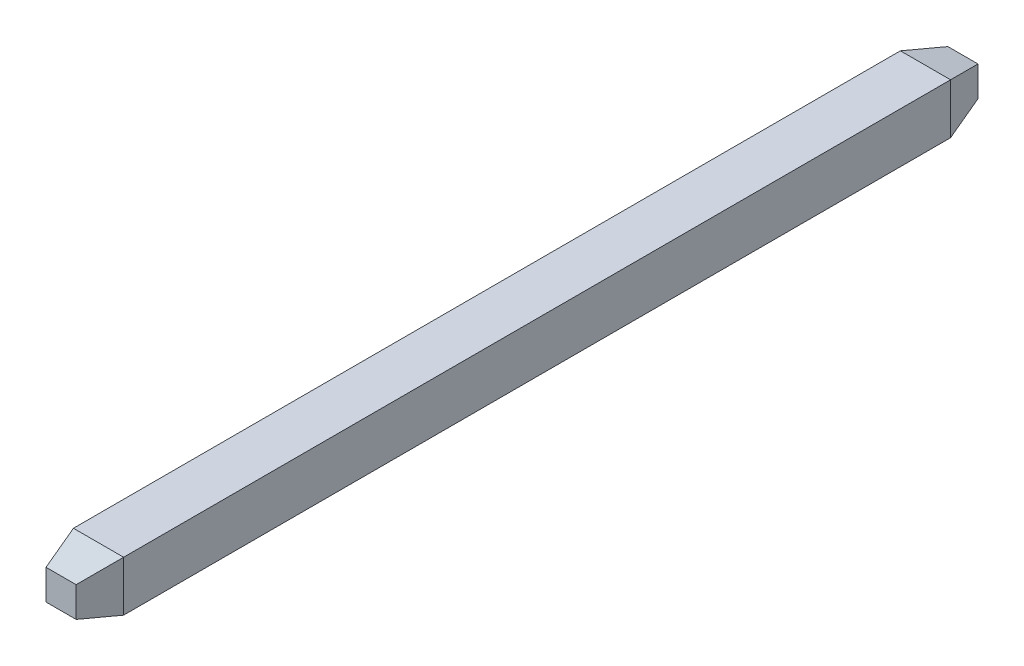
ISO-10303-21;
HEADER;
FILE_DESCRIPTION(('STEP AP214'),'2;1');
FILE_NAME('part.step','',(''),(''),'','','');
FILE_SCHEMA(('AUTOMOTIVE_DESIGN { 1 0 10303 214 1 1 1 1 }'));
ENDSEC;
DATA;
#1=APPLICATION_CONTEXT('core data for automotive mechanical design processes');
#2=APPLICATION_PROTOCOL_DEFINITION('international standard','automotive_design',2000,#1);
#3=PRODUCT_CONTEXT('',#1,'mechanical');
#4=PRODUCT('Part','Part','',(#3));
#5=PRODUCT_RELATED_PRODUCT_CATEGORY('part','',(#4));
#6=PRODUCT_DEFINITION_FORMATION('','',#4);
#7=PRODUCT_DEFINITION_CONTEXT('part definition',#1,'design');
#8=PRODUCT_DEFINITION('design','',#6,#7);
#9=PRODUCT_DEFINITION_SHAPE('','',#8);
#10=(LENGTH_UNIT() NAMED_UNIT(*) SI_UNIT(.MILLI.,.METRE.));
#11=(NAMED_UNIT(*) PLANE_ANGLE_UNIT() SI_UNIT($,.RADIAN.));
#12=(NAMED_UNIT(*) SI_UNIT($,.STERADIAN.) SOLID_ANGLE_UNIT());
#13=UNCERTAINTY_MEASURE_WITH_UNIT(LENGTH_MEASURE(1.E-05),#10,'distance_accuracy_value','');
#14=(GEOMETRIC_REPRESENTATION_CONTEXT(3) GLOBAL_UNCERTAINTY_ASSIGNED_CONTEXT((#13)) GLOBAL_UNIT_ASSIGNED_CONTEXT((#10,
#11,#12)) REPRESENTATION_CONTEXT('',''));
#15=CARTESIAN_POINT('',(0.,0.,0.));
#16=DIRECTION('',(0.,0.,1.));
#17=DIRECTION('',(1.,0.,0.));
#18=AXIS2_PLACEMENT_3D('',#15,#16,#17);
#19=CARTESIAN_POINT('',(-1.53140500673763,-0.32,7.92229749663118));
#20=DIRECTION('',(0.,-0.965925826289069,0.25881904510252));
#21=DIRECTION('',(0.,-0.25881904510252,-0.965925826289069));
#22=AXIS2_PLACEMENT_3D('',#19,#20,#21);
#23=PLANE('',#22);
#24=DIRECTION('',(1.,0.,0.));
#25=VECTOR('',#24,1.);
#26=CARTESIAN_POINT('',(0.,-0.192,8.4));
#27=LINE('',#26,#25);
#28=CARTESIAN_POINT('',(-0.192,-0.191999999999999,8.4));
#29=VERTEX_POINT('',#28);
#30=CARTESIAN_POINT('',(0.192,-0.191999999999999,8.4));
#31=VERTEX_POINT('',#30);
#32=EDGE_CURVE('E20',#29,#31,#27,.T.);
#33=ORIENTED_EDGE('',*,*,#32,.F.);
#34=DIRECTION('',(0.250562807085731,0.25056280708573,0.93511312653103));
#35=VECTOR('',#34,1.);
#36=CARTESIAN_POINT('',(-0.32,-0.32,7.92229749663118));
#37=LINE('',#36,#35);
#38=CARTESIAN_POINT('',(-0.32,-0.32,7.92229749663118));
#39=VERTEX_POINT('',#38);
#40=EDGE_CURVE('E110',#39,#29,#37,.T.);
#41=ORIENTED_EDGE('',*,*,#40,.F.);
#42=DIRECTION('',(1.,0.,0.));
#43=VECTOR('',#42,1.);
#44=CARTESIAN_POINT('',(-0.32,-0.32,7.92229749663118));
#45=LINE('',#44,#43);
#46=CARTESIAN_POINT('',(0.32,-0.319999999999999,7.92229749663118));
#47=VERTEX_POINT('',#46);
#48=EDGE_CURVE('E96',#47,#39,#45,.F.);
#49=ORIENTED_EDGE('',*,*,#48,.F.);
#50=DIRECTION('',(0.250562807085731,-0.25056280708573,-0.93511312653103));
#51=VECTOR('',#50,1.);
#52=CARTESIAN_POINT('',(0.191999999999999,-0.191999999999999,8.4));
#53=LINE('',#52,#51);
#54=EDGE_CURVE('E94',#31,#47,#53,.T.);
#55=ORIENTED_EDGE('',*,*,#54,.F.);
#56=EDGE_LOOP('',(#33,#41,#49,#55));
#57=FACE_BOUND('',#56,.T.);
#58=ADVANCED_FACE('F17',(#57),#23,.T.);
#59=CARTESIAN_POINT('',(-1.53140500673763,-0.32,-2.62229749663118));
#60=DIRECTION('',(0.,0.965925826289068,0.258819045102521));
#61=DIRECTION('',(0.,-0.258819045102521,0.965925826289068));
#62=AXIS2_PLACEMENT_3D('',#59,#60,#61);
#63=PLANE('',#62);
#64=DIRECTION('',(0.250562807085732,0.25056280708573,-0.93511312653103));
#65=VECTOR('',#64,1.);
#66=CARTESIAN_POINT('',(-0.32,-0.32,-2.62229749663118));
#67=LINE('',#66,#65);
#68=CARTESIAN_POINT('',(-0.32,-0.32,-2.62229749663118));
#69=VERTEX_POINT('',#68);
#70=CARTESIAN_POINT('',(-0.192,-0.191999999999999,-3.1));
#71=VERTEX_POINT('',#70);
#72=EDGE_CURVE('E113',#69,#71,#67,.T.);
#73=ORIENTED_EDGE('',*,*,#72,.T.);
#74=DIRECTION('',(1.,0.,0.));
#75=VECTOR('',#74,1.);
#76=CARTESIAN_POINT('',(0.,-0.192,-3.1));
#77=LINE('',#76,#75);
#78=CARTESIAN_POINT('',(0.192,-0.191999999999999,-3.1));
#79=VERTEX_POINT('',#78);
#80=EDGE_CURVE('E79',#71,#79,#77,.T.);
#81=ORIENTED_EDGE('',*,*,#80,.T.);
#82=DIRECTION('',(0.250562807085732,-0.25056280708573,0.93511312653103));
#83=VECTOR('',#82,1.);
#84=CARTESIAN_POINT('',(0.191999999999998,-0.191999999999999,-3.1));
#85=LINE('',#84,#83);
#86=CARTESIAN_POINT('',(0.32,-0.319999999999999,-2.62229749663118));
#87=VERTEX_POINT('',#86);
#88=EDGE_CURVE('E108',#79,#87,#85,.T.);
#89=ORIENTED_EDGE('',*,*,#88,.T.);
#90=DIRECTION('',(1.,0.,0.));
#91=VECTOR('',#90,1.);
#92=CARTESIAN_POINT('',(-0.32,-0.32,-2.62229749663118));
#93=LINE('',#92,#91);
#94=EDGE_CURVE('E118',#69,#87,#93,.T.);
#95=ORIENTED_EDGE('',*,*,#94,.F.);
#96=EDGE_LOOP('',(#73,#81,#89,#95));
#97=FACE_BOUND('',#96,.T.);
#98=ADVANCED_FACE('F281',(#97),#63,.F.);
#99=CARTESIAN_POINT('',(0.,0.,8.4));
#100=DIRECTION('',(0.,0.,1.));
#101=DIRECTION('',(1.,0.,0.));
#102=AXIS2_PLACEMENT_3D('',#99,#100,#101);
#103=PLANE('',#102);
#104=ORIENTED_EDGE('',*,*,#32,.T.);
#105=DIRECTION('',(0.,1.,0.));
#106=VECTOR('',#105,1.);
#107=CARTESIAN_POINT('',(0.191999999999999,-1.53140500673763,8.4));
#108=LINE('',#107,#106);
#109=CARTESIAN_POINT('',(0.191999999999999,0.192000000000001,8.4));
#110=VERTEX_POINT('',#109);
#111=EDGE_CURVE('E88',#110,#31,#108,.F.);
#112=ORIENTED_EDGE('',*,*,#111,.F.);
#113=DIRECTION('',(1.,0.,0.));
#114=VECTOR('',#113,1.);
#115=CARTESIAN_POINT('',(1.53140500673763,0.191999999999999,8.4));
#116=LINE('',#115,#114);
#117=CARTESIAN_POINT('',(-0.192,0.192,8.4));
#118=VERTEX_POINT('',#117);
#119=EDGE_CURVE('E124',#118,#110,#116,.T.);
#120=ORIENTED_EDGE('',*,*,#119,.F.);
#121=DIRECTION('',(0.,1.,0.));
#122=VECTOR('',#121,1.);
#123=CARTESIAN_POINT('',(-0.192,1.53140500673763,8.4));
#124=LINE('',#123,#122);
#125=EDGE_CURVE('E90',#29,#118,#124,.T.);
#126=ORIENTED_EDGE('',*,*,#125,.F.);
#127=EDGE_LOOP('',(#104,#112,#120,#126));
#128=FACE_BOUND('',#127,.T.);
#129=ADVANCED_FACE('F85',(#128),#103,.T.);
#130=CARTESIAN_POINT('',(0.32,-1.53140500673763,7.92229749663118));
#131=DIRECTION('',(0.965925826289069,0.,0.25881904510252));
#132=DIRECTION('',(0.25881904510252,0.,-0.965925826289069));
#133=AXIS2_PLACEMENT_3D('',#130,#131,#132);
#134=PLANE('',#133);
#135=ORIENTED_EDGE('',*,*,#111,.T.);
#136=ORIENTED_EDGE('',*,*,#54,.T.);
#137=DIRECTION('',(0.,1.,0.));
#138=VECTOR('',#137,1.);
#139=CARTESIAN_POINT('',(0.32,-0.319999999999999,7.92229749663118));
#140=LINE('',#139,#138);
#141=CARTESIAN_POINT('',(0.32,0.32,7.92229749663118));
#142=VERTEX_POINT('',#141);
#143=EDGE_CURVE('E127',#142,#47,#140,.F.);
#144=ORIENTED_EDGE('',*,*,#143,.F.);
#145=DIRECTION('',(0.250562807085731,0.250562807085731,-0.93511312653103));
#146=VECTOR('',#145,1.);
#147=CARTESIAN_POINT('',(0.191999999999999,0.192,8.4));
#148=LINE('',#147,#146);
#149=EDGE_CURVE('E102',#110,#142,#148,.T.);
#150=ORIENTED_EDGE('',*,*,#149,.F.);
#151=EDGE_LOOP('',(#135,#136,#144,#150));
#152=FACE_BOUND('',#151,.T.);
#153=ADVANCED_FACE('F100',(#152),#134,.T.);
#154=CARTESIAN_POINT('',(0.,0.,-3.1));
#155=DIRECTION('',(0.,0.,1.));
#156=DIRECTION('',(1.,0.,0.));
#157=AXIS2_PLACEMENT_3D('',#154,#155,#156);
#158=PLANE('',#157);
#159=DIRECTION('',(0.,1.,0.));
#160=VECTOR('',#159,1.);
#161=CARTESIAN_POINT('',(0.191999999999999,-1.53140500673763,-3.1));
#162=LINE('',#161,#160);
#163=CARTESIAN_POINT('',(0.191999999999999,0.192000000000001,-3.1));
#164=VERTEX_POINT('',#163);
#165=EDGE_CURVE('E106',#164,#79,#162,.F.);
#166=ORIENTED_EDGE('',*,*,#165,.T.);
#167=ORIENTED_EDGE('',*,*,#80,.F.);
#168=DIRECTION('',(0.,1.,0.));
#169=VECTOR('',#168,1.);
#170=CARTESIAN_POINT('',(-0.192,1.53140500673763,-3.1));
#171=LINE('',#170,#169);
#172=CARTESIAN_POINT('',(-0.192,0.192,-3.1));
#173=VERTEX_POINT('',#172);
#174=EDGE_CURVE('E115',#71,#173,#171,.T.);
#175=ORIENTED_EDGE('',*,*,#174,.T.);
#176=DIRECTION('',(1.,0.,0.));
#177=VECTOR('',#176,1.);
#178=CARTESIAN_POINT('',(1.53140500673763,0.191999999999999,-3.1));
#179=LINE('',#178,#177);
#180=EDGE_CURVE('E138',#173,#164,#179,.T.);
#181=ORIENTED_EDGE('',*,*,#180,.T.);
#182=EDGE_LOOP('',(#166,#167,#175,#181));
#183=FACE_BOUND('',#182,.T.);
#184=ADVANCED_FACE('F257',(#183),#158,.F.);
#185=CARTESIAN_POINT('',(0.32,-1.53140500673763,-2.62229749663118));
#186=DIRECTION('',(-0.965925826289068,0.,0.258819045102521));
#187=DIRECTION('',(0.258819045102521,0.,0.965925826289068));
#188=AXIS2_PLACEMENT_3D('',#185,#186,#187);
#189=PLANE('',#188);
#190=ORIENTED_EDGE('',*,*,#88,.F.);
#191=ORIENTED_EDGE('',*,*,#165,.F.);
#192=DIRECTION('',(0.250562807085731,0.250562807085732,0.935113126531029));
#193=VECTOR('',#192,1.);
#194=CARTESIAN_POINT('',(0.191999999999999,0.191999999999999,-3.1));
#195=LINE('',#194,#193);
#196=CARTESIAN_POINT('',(0.32,0.32,-2.62229749663118));
#197=VERTEX_POINT('',#196);
#198=EDGE_CURVE('E140',#164,#197,#195,.T.);
#199=ORIENTED_EDGE('',*,*,#198,.T.);
#200=DIRECTION('',(0.,1.,0.));
#201=VECTOR('',#200,1.);
#202=CARTESIAN_POINT('',(0.32,-0.319999999999999,-2.62229749663118));
#203=LINE('',#202,#201);
#204=EDGE_CURVE('E133',#87,#197,#203,.T.);
#205=ORIENTED_EDGE('',*,*,#204,.F.);
#206=EDGE_LOOP('',(#190,#191,#199,#205));
#207=FACE_BOUND('',#206,.T.);
#208=ADVANCED_FACE('F249',(#207),#189,.F.);
#209=CARTESIAN_POINT('',(-0.320000000000001,1.53140500673763,7.92229749663118));
#210=DIRECTION('',(-0.965925826289069,0.,0.25881904510252));
#211=DIRECTION('',(0.25881904510252,0.,0.965925826289069));
#212=AXIS2_PLACEMENT_3D('',#209,#210,#211);
#213=PLANE('',#212);
#214=ORIENTED_EDGE('',*,*,#125,.T.);
#215=DIRECTION('',(0.25056280708573,-0.250562807085731,0.93511312653103));
#216=VECTOR('',#215,1.);
#217=CARTESIAN_POINT('',(-0.320000000000001,0.320000000000001,7.92229749663118));
#218=LINE('',#217,#216);
#219=CARTESIAN_POINT('',(-0.320000000000001,0.32,7.92229749663118));
#220=VERTEX_POINT('',#219);
#221=EDGE_CURVE('E121',#220,#118,#218,.T.);
#222=ORIENTED_EDGE('',*,*,#221,.F.);
#223=DIRECTION('',(0.,-1.,0.));
#224=VECTOR('',#223,1.);
#225=CARTESIAN_POINT('',(-0.320000000000001,0.320000000000001,7.92229749663118));
#226=LINE('',#225,#224);
#227=EDGE_CURVE('E142',#39,#220,#226,.F.);
#228=ORIENTED_EDGE('',*,*,#227,.F.);
#229=ORIENTED_EDGE('',*,*,#40,.T.);
#230=EDGE_LOOP('',(#214,#222,#228,#229));
#231=FACE_BOUND('',#230,.T.);
#232=ADVANCED_FACE('F171',(#231),#213,.T.);
#233=CARTESIAN_POINT('',(-0.320000000000001,1.53140500673763,-2.62229749663118));
#234=DIRECTION('',(0.965925826289068,0.,0.258819045102521));
#235=DIRECTION('',(0.258819045102521,0.,-0.965925826289068));
#236=AXIS2_PLACEMENT_3D('',#233,#234,#235);
#237=PLANE('',#236);
#238=DIRECTION('',(0.25056280708573,-0.250562807085732,-0.93511312653103));
#239=VECTOR('',#238,1.);
#240=CARTESIAN_POINT('',(-0.320000000000001,0.320000000000001,-2.62229749663118));
#241=LINE('',#240,#239);
#242=CARTESIAN_POINT('',(-0.320000000000001,0.320000000000001,-2.62229749663118));
#243=VERTEX_POINT('',#242);
#244=EDGE_CURVE('E136',#243,#173,#241,.T.);
#245=ORIENTED_EDGE('',*,*,#244,.T.);
#246=ORIENTED_EDGE('',*,*,#174,.F.);
#247=ORIENTED_EDGE('',*,*,#72,.F.);
#248=DIRECTION('',(0.,-1.,0.));
#249=VECTOR('',#248,1.);
#250=CARTESIAN_POINT('',(-0.320000000000001,0.320000000000001,-2.62229749663118));
#251=LINE('',#250,#249);
#252=EDGE_CURVE('E35',#243,#69,#251,.T.);
#253=ORIENTED_EDGE('',*,*,#252,.F.);
#254=EDGE_LOOP('',(#245,#246,#247,#253));
#255=FACE_BOUND('',#254,.T.);
#256=ADVANCED_FACE('F188',(#255),#237,.F.);
#257=CARTESIAN_POINT('',(-0.32,-0.32,-3.1));
#258=DIRECTION('',(0.,-1.,0.));
#259=DIRECTION('',(1.,0.,0.));
#260=AXIS2_PLACEMENT_3D('',#257,#258,#259);
#261=PLANE('',#260);
#262=ORIENTED_EDGE('',*,*,#94,.T.);
#263=DIRECTION('',(0.,0.,1.));
#264=VECTOR('',#263,1.);
#265=CARTESIAN_POINT('',(0.32,-0.319999999999999,-3.1));
#266=LINE('',#265,#264);
#267=EDGE_CURVE('E130',#47,#87,#266,.F.);
#268=ORIENTED_EDGE('',*,*,#267,.F.);
#269=ORIENTED_EDGE('',*,*,#48,.T.);
#270=DIRECTION('',(0.,0.,1.));
#271=VECTOR('',#270,1.);
#272=CARTESIAN_POINT('',(-0.320000000000001,-0.32,-3.1));
#273=LINE('',#272,#271);
#274=EDGE_CURVE('E146',#69,#39,#273,.T.);
#275=ORIENTED_EDGE('',*,*,#274,.F.);
#276=EDGE_LOOP('',(#262,#268,#269,#275));
#277=FACE_BOUND('',#276,.T.);
#278=ADVANCED_FACE('F174',(#277),#261,.T.);
#279=CARTESIAN_POINT('',(1.53140500673763,0.32,7.92229749663118));
#280=DIRECTION('',(0.,0.965925826289069,0.25881904510252));
#281=DIRECTION('',(0.,-0.25881904510252,0.965925826289069));
#282=AXIS2_PLACEMENT_3D('',#279,#280,#281);
#283=PLANE('',#282);
#284=ORIENTED_EDGE('',*,*,#119,.T.);
#285=ORIENTED_EDGE('',*,*,#149,.T.);
#286=DIRECTION('',(-1.,0.,0.));
#287=VECTOR('',#286,1.);
#288=CARTESIAN_POINT('',(0.32,0.32,7.92229749663118));
#289=LINE('',#288,#287);
#290=EDGE_CURVE('E149',#220,#142,#289,.F.);
#291=ORIENTED_EDGE('',*,*,#290,.F.);
#292=ORIENTED_EDGE('',*,*,#221,.T.);
#293=EDGE_LOOP('',(#284,#285,#291,#292));
#294=FACE_BOUND('',#293,.T.);
#295=ADVANCED_FACE('F179',(#294),#283,.T.);
#296=CARTESIAN_POINT('',(0.32,-0.319999999999999,-3.1));
#297=DIRECTION('',(1.,0.,0.));
#298=DIRECTION('',(0.,1.,0.));
#299=AXIS2_PLACEMENT_3D('',#296,#297,#298);
#300=PLANE('',#299);
#301=ORIENTED_EDGE('',*,*,#204,.T.);
#302=DIRECTION('',(0.,0.,1.));
#303=VECTOR('',#302,1.);
#304=CARTESIAN_POINT('',(0.32,0.32,-3.1));
#305=LINE('',#304,#303);
#306=EDGE_CURVE('E152',#142,#197,#305,.F.);
#307=ORIENTED_EDGE('',*,*,#306,.F.);
#308=ORIENTED_EDGE('',*,*,#143,.T.);
#309=ORIENTED_EDGE('',*,*,#267,.T.);
#310=EDGE_LOOP('',(#301,#307,#308,#309));
#311=FACE_BOUND('',#310,.T.);
#312=ADVANCED_FACE('F177',(#311),#300,.T.);
#313=CARTESIAN_POINT('',(1.53140500673763,0.32,-2.62229749663118));
#314=DIRECTION('',(0.,-0.965925826289068,0.258819045102521));
#315=DIRECTION('',(0.,-0.258819045102521,-0.965925826289068));
#316=AXIS2_PLACEMENT_3D('',#313,#314,#315);
#317=PLANE('',#316);
#318=ORIENTED_EDGE('',*,*,#198,.F.);
#319=ORIENTED_EDGE('',*,*,#180,.F.);
#320=ORIENTED_EDGE('',*,*,#244,.F.);
#321=DIRECTION('',(-1.,0.,0.));
#322=VECTOR('',#321,1.);
#323=CARTESIAN_POINT('',(0.32,0.32,-2.62229749663118));
#324=LINE('',#323,#322);
#325=EDGE_CURVE('E26',#197,#243,#324,.T.);
#326=ORIENTED_EDGE('',*,*,#325,.F.);
#327=EDGE_LOOP('',(#318,#319,#320,#326));
#328=FACE_BOUND('',#327,.T.);
#329=ADVANCED_FACE('F163',(#328),#317,.F.);
#330=CARTESIAN_POINT('',(-0.320000000000001,0.320000000000001,-3.1));
#331=DIRECTION('',(-1.,0.,0.));
#332=DIRECTION('',(0.,-1.,0.));
#333=AXIS2_PLACEMENT_3D('',#330,#331,#332);
#334=PLANE('',#333);
#335=ORIENTED_EDGE('',*,*,#252,.T.);
#336=ORIENTED_EDGE('',*,*,#274,.T.);
#337=ORIENTED_EDGE('',*,*,#227,.T.);
#338=DIRECTION('',(0.,0.,1.));
#339=VECTOR('',#338,1.);
#340=CARTESIAN_POINT('',(-0.320000000000001,0.32,-3.1));
#341=LINE('',#340,#339);
#342=EDGE_CURVE('E11',#243,#220,#341,.T.);
#343=ORIENTED_EDGE('',*,*,#342,.F.);
#344=EDGE_LOOP('',(#335,#336,#337,#343));
#345=FACE_BOUND('',#344,.T.);
#346=ADVANCED_FACE('F167',(#345),#334,.T.);
#347=CARTESIAN_POINT('',(0.32,0.32,-3.1));
#348=DIRECTION('',(0.,1.,0.));
#349=DIRECTION('',(-1.,0.,0.));
#350=AXIS2_PLACEMENT_3D('',#347,#348,#349);
#351=PLANE('',#350);
#352=ORIENTED_EDGE('',*,*,#325,.T.);
#353=ORIENTED_EDGE('',*,*,#342,.T.);
#354=ORIENTED_EDGE('',*,*,#290,.T.);
#355=ORIENTED_EDGE('',*,*,#306,.T.);
#356=EDGE_LOOP('',(#352,#353,#354,#355));
#357=FACE_BOUND('',#356,.T.);
#358=ADVANCED_FACE('F158',(#357),#351,.T.);
#359=CLOSED_SHELL('',(#58,#98,#129,#153,#184,#208,#232,#256,#278,#295,#312,#329,#346,#358));
#360=MANIFOLD_SOLID_BREP('B1',#359);
#361=ADVANCED_BREP_SHAPE_REPRESENTATION('',(#18,#360),#14);
#362=SHAPE_DEFINITION_REPRESENTATION(#9,#361);
ENDSEC;
END-ISO-10303-21;
